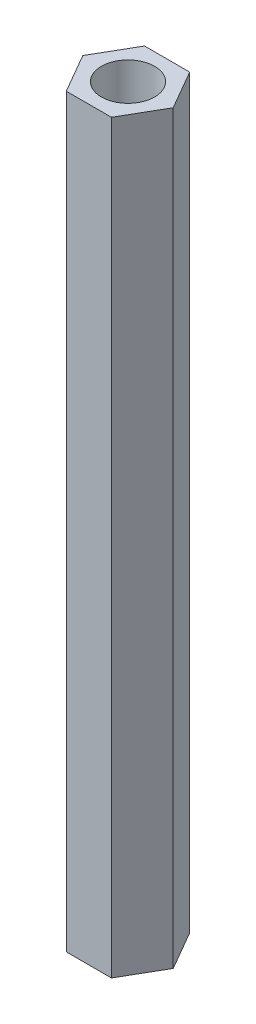
ISO-10303-21;
HEADER;
FILE_DESCRIPTION(('STEP AP214'),'2;1');
FILE_NAME('part.step','',(''),(''),'','','');
FILE_SCHEMA(('AUTOMOTIVE_DESIGN { 1 0 10303 214 1 1 1 1 }'));
ENDSEC;
DATA;
#1=APPLICATION_CONTEXT('core data for automotive mechanical design processes');
#2=APPLICATION_PROTOCOL_DEFINITION('international standard','automotive_design',2000,#1);
#3=PRODUCT_CONTEXT('',#1,'mechanical');
#4=PRODUCT('Part','Part','',(#3));
#5=PRODUCT_RELATED_PRODUCT_CATEGORY('part','',(#4));
#6=PRODUCT_DEFINITION_FORMATION('','',#4);
#7=PRODUCT_DEFINITION_CONTEXT('part definition',#1,'design');
#8=PRODUCT_DEFINITION('design','',#6,#7);
#9=PRODUCT_DEFINITION_SHAPE('','',#8);
#10=(LENGTH_UNIT() NAMED_UNIT(*) SI_UNIT(.MILLI.,.METRE.));
#11=(NAMED_UNIT(*) PLANE_ANGLE_UNIT() SI_UNIT($,.RADIAN.));
#12=(NAMED_UNIT(*) SI_UNIT($,.STERADIAN.) SOLID_ANGLE_UNIT());
#13=UNCERTAINTY_MEASURE_WITH_UNIT(LENGTH_MEASURE(1.E-05),#10,'distance_accuracy_value','');
#14=(GEOMETRIC_REPRESENTATION_CONTEXT(3) GLOBAL_UNCERTAINTY_ASSIGNED_CONTEXT((#13)) GLOBAL_UNIT_ASSIGNED_CONTEXT((#10,
#11,#12)) REPRESENTATION_CONTEXT('',''));
#15=CARTESIAN_POINT('',(0.,0.,0.));
#16=DIRECTION('',(0.,0.,1.));
#17=DIRECTION('',(1.,0.,0.));
#18=AXIS2_PLACEMENT_3D('',#15,#16,#17);
#19=CARTESIAN_POINT('',(0.,28.,0.));
#20=DIRECTION('',(0.,1.,0.));
#21=DIRECTION('',(0.,0.,1.));
#22=AXIS2_PLACEMENT_3D('',#19,#20,#21);
#23=PLANE('',#22);
#24=DIRECTION('',(-0.5,0.,-0.866025403784438));
#25=VECTOR('',#24,1.);
#26=CARTESIAN_POINT('',(1.69740979141749,28.,0.));
#27=LINE('',#26,#25);
#28=CARTESIAN_POINT('',(1.69740979141749,28.,0.));
#29=VERTEX_POINT('',#28);
#30=CARTESIAN_POINT('',(0.848704895708744,28.,-1.46999999999999));
#31=VERTEX_POINT('',#30);
#32=EDGE_CURVE('E133',#29,#31,#27,.T.);
#33=ORIENTED_EDGE('',*,*,#32,.T.);
#34=DIRECTION('',(-1.,0.,0.));
#35=VECTOR('',#34,1.);
#36=CARTESIAN_POINT('',(0.848704895708744,28.,-1.46999999999999));
#37=LINE('',#36,#35);
#38=CARTESIAN_POINT('',(-0.848704895708744,28.,-1.46999999999999));
#39=VERTEX_POINT('',#38);
#40=EDGE_CURVE('E91',#31,#39,#37,.T.);
#41=ORIENTED_EDGE('',*,*,#40,.T.);
#42=DIRECTION('',(-0.5,0.,0.866025403784439));
#43=VECTOR('',#42,1.);
#44=CARTESIAN_POINT('',(-0.848704895708744,28.,-1.46999999999999));
#45=LINE('',#44,#43);
#46=CARTESIAN_POINT('',(-1.69740979141749,28.,0.));
#47=VERTEX_POINT('',#46);
#48=EDGE_CURVE('E104',#39,#47,#45,.T.);
#49=ORIENTED_EDGE('',*,*,#48,.T.);
#50=DIRECTION('',(0.500000000000001,0.,0.866025403784438));
#51=VECTOR('',#50,1.);
#52=CARTESIAN_POINT('',(-1.69740979141749,28.,0.));
#53=LINE('',#52,#51);
#54=CARTESIAN_POINT('',(-0.848704895708743,28.,1.46999999999999));
#55=VERTEX_POINT('',#54);
#56=EDGE_CURVE('E98',#47,#55,#53,.T.);
#57=ORIENTED_EDGE('',*,*,#56,.T.);
#58=DIRECTION('',(1.,0.,0.));
#59=VECTOR('',#58,1.);
#60=CARTESIAN_POINT('',(-0.848704895708743,28.,1.46999999999999));
#61=LINE('',#60,#59);
#62=CARTESIAN_POINT('',(0.848704895708744,28.,1.46999999999999));
#63=VERTEX_POINT('',#62);
#64=EDGE_CURVE('E102',#55,#63,#61,.T.);
#65=ORIENTED_EDGE('',*,*,#64,.T.);
#66=DIRECTION('',(0.499999999999999,0.,-0.866025403784439));
#67=VECTOR('',#66,1.);
#68=CARTESIAN_POINT('',(0.848704895708744,28.,1.46999999999999));
#69=LINE('',#68,#67);
#70=EDGE_CURVE('E54',#63,#29,#69,.T.);
#71=ORIENTED_EDGE('',*,*,#70,.T.);
#72=EDGE_LOOP('',(#33,#41,#49,#57,#65,#71));
#73=FACE_BOUND('',#72,.T.);
#74=CARTESIAN_POINT('',(0.,28.,0.));
#75=DIRECTION('',(0.,1.,0.));
#76=DIRECTION('',(0.,0.,1.));
#77=AXIS2_PLACEMENT_3D('',#74,#75,#76);
#78=CIRCLE('',#77,1.);
#79=CARTESIAN_POINT('',(0.,28.,1.));
#80=VERTEX_POINT('',#79);
#81=EDGE_CURVE('E126',#80,#80,#78,.T.);
#82=ORIENTED_EDGE('',*,*,#81,.F.);
#83=EDGE_LOOP('',(#82));
#84=FACE_BOUND('',#83,.T.);
#85=ADVANCED_FACE('F37',(#73,#84),#23,.T.);
#86=CARTESIAN_POINT('',(0.,0.,0.));
#87=DIRECTION('',(0.,1.,0.));
#88=DIRECTION('',(0.,0.,1.));
#89=AXIS2_PLACEMENT_3D('',#86,#87,#88);
#90=PLANE('',#89);
#91=DIRECTION('',(-0.5,0.,-0.866025403784438));
#92=VECTOR('',#91,1.);
#93=CARTESIAN_POINT('',(1.69740979141749,0.,0.));
#94=LINE('',#93,#92);
#95=CARTESIAN_POINT('',(1.69740979141749,0.,0.));
#96=VERTEX_POINT('',#95);
#97=CARTESIAN_POINT('',(0.848704895708744,0.,-1.46999999999999));
#98=VERTEX_POINT('',#97);
#99=EDGE_CURVE('E122',#96,#98,#94,.T.);
#100=ORIENTED_EDGE('',*,*,#99,.F.);
#101=DIRECTION('',(0.499999999999999,0.,-0.866025403784439));
#102=VECTOR('',#101,1.);
#103=CARTESIAN_POINT('',(0.848704895708744,0.,1.46999999999999));
#104=LINE('',#103,#102);
#105=CARTESIAN_POINT('',(0.848704895708744,0.,1.46999999999999));
#106=VERTEX_POINT('',#105);
#107=EDGE_CURVE('E83',#106,#96,#104,.T.);
#108=ORIENTED_EDGE('',*,*,#107,.F.);
#109=DIRECTION('',(1.,0.,0.));
#110=VECTOR('',#109,1.);
#111=CARTESIAN_POINT('',(-0.848704895708743,0.,1.46999999999999));
#112=LINE('',#111,#110);
#113=CARTESIAN_POINT('',(-0.848704895708743,0.,1.46999999999999));
#114=VERTEX_POINT('',#113);
#115=EDGE_CURVE('E77',#114,#106,#112,.T.);
#116=ORIENTED_EDGE('',*,*,#115,.F.);
#117=DIRECTION('',(0.500000000000001,0.,0.866025403784438));
#118=VECTOR('',#117,1.);
#119=CARTESIAN_POINT('',(-1.69740979141749,0.,0.));
#120=LINE('',#119,#118);
#121=CARTESIAN_POINT('',(-1.69740979141749,0.,0.));
#122=VERTEX_POINT('',#121);
#123=EDGE_CURVE('E112',#122,#114,#120,.T.);
#124=ORIENTED_EDGE('',*,*,#123,.F.);
#125=DIRECTION('',(-0.5,0.,0.866025403784439));
#126=VECTOR('',#125,1.);
#127=CARTESIAN_POINT('',(-0.848704895708744,0.,-1.46999999999999));
#128=LINE('',#127,#126);
#129=CARTESIAN_POINT('',(-0.848704895708744,0.,-1.46999999999999));
#130=VERTEX_POINT('',#129);
#131=EDGE_CURVE('E128',#130,#122,#128,.T.);
#132=ORIENTED_EDGE('',*,*,#131,.F.);
#133=DIRECTION('',(-1.,0.,0.));
#134=VECTOR('',#133,1.);
#135=CARTESIAN_POINT('',(0.848704895708744,0.,-1.46999999999999));
#136=LINE('',#135,#134);
#137=EDGE_CURVE('E125',#98,#130,#136,.T.);
#138=ORIENTED_EDGE('',*,*,#137,.F.);
#139=EDGE_LOOP('',(#100,#108,#116,#124,#132,#138));
#140=FACE_BOUND('',#139,.T.);
#141=CARTESIAN_POINT('',(0.,0.,0.));
#142=DIRECTION('',(0.,1.,0.));
#143=DIRECTION('',(0.,0.,1.));
#144=AXIS2_PLACEMENT_3D('',#141,#142,#143);
#145=CIRCLE('',#144,1.);
#146=CARTESIAN_POINT('',(0.,0.,1.));
#147=VERTEX_POINT('',#146);
#148=EDGE_CURVE('E226',#147,#147,#145,.T.);
#149=ORIENTED_EDGE('',*,*,#148,.T.);
#150=EDGE_LOOP('',(#149));
#151=FACE_BOUND('',#150,.T.);
#152=ADVANCED_FACE('F142',(#140,#151),#90,.F.);
#153=CARTESIAN_POINT('',(1.69740979141749,28.,0.));
#154=DIRECTION('',(-0.866025403784438,0.,0.5));
#155=DIRECTION('',(0.5,0.,0.866025403784439));
#156=AXIS2_PLACEMENT_3D('',#153,#154,#155);
#157=PLANE('',#156);
#158=ORIENTED_EDGE('',*,*,#99,.T.);
#159=DIRECTION('',(0.,-1.,0.));
#160=VECTOR('',#159,1.);
#161=CARTESIAN_POINT('',(0.848704895708744,28.,-1.46999999999999));
#162=LINE('',#161,#160);
#163=EDGE_CURVE('E11',#31,#98,#162,.T.);
#164=ORIENTED_EDGE('',*,*,#163,.F.);
#165=ORIENTED_EDGE('',*,*,#32,.F.);
#166=DIRECTION('',(0.,-1.,0.));
#167=VECTOR('',#166,1.);
#168=CARTESIAN_POINT('',(1.69740979141749,28.,0.));
#169=LINE('',#168,#167);
#170=EDGE_CURVE('E118',#29,#96,#169,.T.);
#171=ORIENTED_EDGE('',*,*,#170,.T.);
#172=EDGE_LOOP('',(#158,#164,#165,#171));
#173=FACE_BOUND('',#172,.T.);
#174=ADVANCED_FACE('F39',(#173),#157,.F.);
#175=CARTESIAN_POINT('',(0.848704895708744,28.,-1.46999999999999));
#176=DIRECTION('',(0.,0.,1.));
#177=DIRECTION('',(1.,0.,0.));
#178=AXIS2_PLACEMENT_3D('',#175,#176,#177);
#179=PLANE('',#178);
#180=ORIENTED_EDGE('',*,*,#137,.T.);
#181=DIRECTION('',(0.,-1.,0.));
#182=VECTOR('',#181,1.);
#183=CARTESIAN_POINT('',(-0.848704895708744,28.,-1.46999999999999));
#184=LINE('',#183,#182);
#185=EDGE_CURVE('E46',#39,#130,#184,.T.);
#186=ORIENTED_EDGE('',*,*,#185,.F.);
#187=ORIENTED_EDGE('',*,*,#40,.F.);
#188=ORIENTED_EDGE('',*,*,#163,.T.);
#189=EDGE_LOOP('',(#180,#186,#187,#188));
#190=FACE_BOUND('',#189,.T.);
#191=ADVANCED_FACE('F167',(#190),#179,.F.);
#192=CARTESIAN_POINT('',(-0.848704895708744,28.,-1.46999999999999));
#193=DIRECTION('',(0.866025403784439,0.,0.5));
#194=DIRECTION('',(0.5,0.,-0.866025403784439));
#195=AXIS2_PLACEMENT_3D('',#192,#193,#194);
#196=PLANE('',#195);
#197=ORIENTED_EDGE('',*,*,#131,.T.);
#198=DIRECTION('',(0.,-1.,0.));
#199=VECTOR('',#198,1.);
#200=CARTESIAN_POINT('',(-1.69740979141749,28.,0.));
#201=LINE('',#200,#199);
#202=EDGE_CURVE('E113',#47,#122,#201,.T.);
#203=ORIENTED_EDGE('',*,*,#202,.F.);
#204=ORIENTED_EDGE('',*,*,#48,.F.);
#205=ORIENTED_EDGE('',*,*,#185,.T.);
#206=EDGE_LOOP('',(#197,#203,#204,#205));
#207=FACE_BOUND('',#206,.T.);
#208=ADVANCED_FACE('F139',(#207),#196,.F.);
#209=CARTESIAN_POINT('',(-1.69740979141749,28.,0.));
#210=DIRECTION('',(0.866025403784438,0.,-0.500000000000001));
#211=DIRECTION('',(-0.500000000000001,0.,-0.866025403784438));
#212=AXIS2_PLACEMENT_3D('',#209,#210,#211);
#213=PLANE('',#212);
#214=ORIENTED_EDGE('',*,*,#123,.T.);
#215=DIRECTION('',(0.,-1.,0.));
#216=VECTOR('',#215,1.);
#217=CARTESIAN_POINT('',(-0.848704895708743,28.,1.46999999999999));
#218=LINE('',#217,#216);
#219=EDGE_CURVE('E109',#55,#114,#218,.T.);
#220=ORIENTED_EDGE('',*,*,#219,.F.);
#221=ORIENTED_EDGE('',*,*,#56,.F.);
#222=ORIENTED_EDGE('',*,*,#202,.T.);
#223=EDGE_LOOP('',(#214,#220,#221,#222));
#224=FACE_BOUND('',#223,.T.);
#225=ADVANCED_FACE('F110',(#224),#213,.F.);
#226=CARTESIAN_POINT('',(-0.848704895708743,28.,1.46999999999999));
#227=DIRECTION('',(0.,0.,-1.));
#228=DIRECTION('',(-1.,0.,0.));
#229=AXIS2_PLACEMENT_3D('',#226,#227,#228);
#230=PLANE('',#229);
#231=ORIENTED_EDGE('',*,*,#115,.T.);
#232=DIRECTION('',(0.,-1.,0.));
#233=VECTOR('',#232,1.);
#234=CARTESIAN_POINT('',(0.848704895708744,28.,1.46999999999999));
#235=LINE('',#234,#233);
#236=EDGE_CURVE('E114',#63,#106,#235,.T.);
#237=ORIENTED_EDGE('',*,*,#236,.F.);
#238=ORIENTED_EDGE('',*,*,#64,.F.);
#239=ORIENTED_EDGE('',*,*,#219,.T.);
#240=EDGE_LOOP('',(#231,#237,#238,#239));
#241=FACE_BOUND('',#240,.T.);
#242=ADVANCED_FACE('F116',(#241),#230,.F.);
#243=CARTESIAN_POINT('',(0.848704895708744,28.,1.46999999999999));
#244=DIRECTION('',(-0.866025403784439,0.,-0.499999999999999));
#245=DIRECTION('',(-0.499999999999999,0.,0.866025403784439));
#246=AXIS2_PLACEMENT_3D('',#243,#244,#245);
#247=PLANE('',#246);
#248=ORIENTED_EDGE('',*,*,#107,.T.);
#249=ORIENTED_EDGE('',*,*,#170,.F.);
#250=ORIENTED_EDGE('',*,*,#70,.F.);
#251=ORIENTED_EDGE('',*,*,#236,.T.);
#252=EDGE_LOOP('',(#248,#249,#250,#251));
#253=FACE_BOUND('',#252,.T.);
#254=ADVANCED_FACE('F147',(#253),#247,.F.);
#255=CARTESIAN_POINT('',(0.,28.,0.));
#256=DIRECTION('',(0.,-1.,0.));
#257=DIRECTION('',(0.,0.,-1.));
#258=AXIS2_PLACEMENT_3D('',#255,#256,#257);
#259=CYLINDRICAL_SURFACE('',#258,1.);
#260=ORIENTED_EDGE('',*,*,#81,.T.);
#261=EDGE_LOOP('',(#260));
#262=FACE_BOUND('',#261,.T.);
#263=ORIENTED_EDGE('',*,*,#148,.F.);
#264=EDGE_LOOP('',(#263));
#265=FACE_BOUND('',#264,.T.);
#266=ADVANCED_FACE('F149',(#262,#265),#259,.F.);
#267=CLOSED_SHELL('',(#85,#152,#174,#191,#208,#225,#242,#254,#266));
#268=MANIFOLD_SOLID_BREP('B2',#267);
#269=ADVANCED_BREP_SHAPE_REPRESENTATION('',(#18,#268),#14);
#270=SHAPE_DEFINITION_REPRESENTATION(#9,#269);
ENDSEC;
END-ISO-10303-21;
